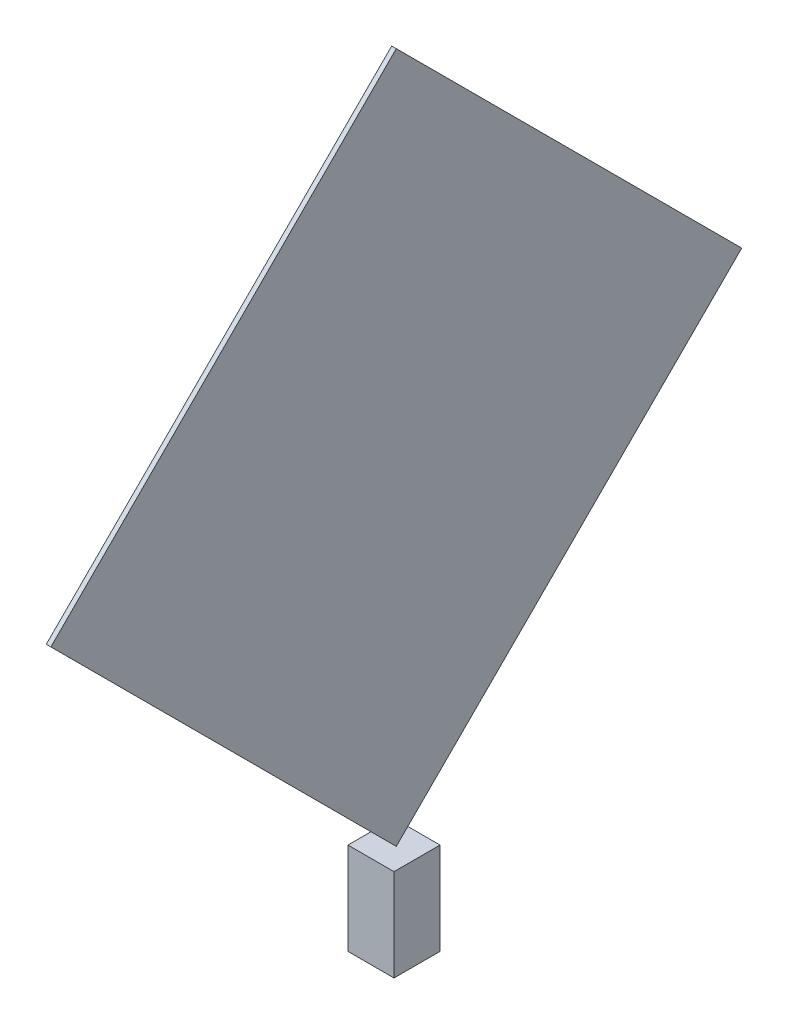
ISO-10303-21;
HEADER;
FILE_DESCRIPTION(('STEP AP214'),'2;1');
FILE_NAME('part.step','',(''),(''),'','','');
FILE_SCHEMA(('AUTOMOTIVE_DESIGN { 1 0 10303 214 1 1 1 1 }'));
ENDSEC;
DATA;
#1=APPLICATION_CONTEXT('core data for automotive mechanical design processes');
#2=APPLICATION_PROTOCOL_DEFINITION('international standard','automotive_design',2000,#1);
#3=PRODUCT_CONTEXT('',#1,'mechanical');
#4=PRODUCT('Part','Part','',(#3));
#5=PRODUCT_RELATED_PRODUCT_CATEGORY('part','',(#4));
#6=PRODUCT_DEFINITION_FORMATION('','',#4);
#7=PRODUCT_DEFINITION_CONTEXT('part definition',#1,'design');
#8=PRODUCT_DEFINITION('design','',#6,#7);
#9=PRODUCT_DEFINITION_SHAPE('','',#8);
#10=(LENGTH_UNIT() NAMED_UNIT(*) SI_UNIT(.MILLI.,.METRE.));
#11=(NAMED_UNIT(*) PLANE_ANGLE_UNIT() SI_UNIT($,.RADIAN.));
#12=(NAMED_UNIT(*) SI_UNIT($,.STERADIAN.) SOLID_ANGLE_UNIT());
#13=UNCERTAINTY_MEASURE_WITH_UNIT(LENGTH_MEASURE(1.E-05),#10,'distance_accuracy_value','');
#14=(GEOMETRIC_REPRESENTATION_CONTEXT(3) GLOBAL_UNCERTAINTY_ASSIGNED_CONTEXT((#13)) GLOBAL_UNIT_ASSIGNED_CONTEXT((#10,
#11,#12)) REPRESENTATION_CONTEXT('',''));
#15=CARTESIAN_POINT('',(0.,0.,0.));
#16=DIRECTION('',(0.,0.,1.));
#17=DIRECTION('',(1.,0.,0.));
#18=AXIS2_PLACEMENT_3D('',#15,#16,#17);
#19=CARTESIAN_POINT('',(-6.80722891566278,950.,-778.313253012048));
#20=DIRECTION('',(0.,0.707106781186547,-0.707106781186548));
#21=DIRECTION('',(0.,0.707106781186548,0.707106781186547));
#22=AXIS2_PLACEMENT_3D('',#19,#20,#21);
#23=PLANE('',#22);
#24=DIRECTION('',(1.,0.,0.));
#25=VECTOR('',#24,1.);
#26=CARTESIAN_POINT('',(-6.80722891566267,1700.,-28.3132530120482));
#27=LINE('',#26,#25);
#28=CARTESIAN_POINT('',(-6.80722891566267,1700.,-28.3132530120482));
#29=VERTEX_POINT('',#28);
#30=CARTESIAN_POINT('',(3.19277108433733,1700.,-28.3132530120482));
#31=VERTEX_POINT('',#30);
#32=EDGE_CURVE('E48',#29,#31,#27,.T.);
#33=ORIENTED_EDGE('',*,*,#32,.T.);
#34=DIRECTION('',(0.,0.707106781186548,0.707106781186547));
#35=VECTOR('',#34,1.);
#36=CARTESIAN_POINT('',(3.19277108433722,950.,-778.313253012048));
#37=LINE('',#36,#35);
#38=CARTESIAN_POINT('',(3.19277108433722,950.,-778.313253012048));
#39=VERTEX_POINT('',#38);
#40=EDGE_CURVE('E85',#39,#31,#37,.T.);
#41=ORIENTED_EDGE('',*,*,#40,.F.);
#42=DIRECTION('',(1.,0.,0.));
#43=VECTOR('',#42,1.);
#44=CARTESIAN_POINT('',(-6.80722891566278,950.,-778.313253012048));
#45=LINE('',#44,#43);
#46=CARTESIAN_POINT('',(-6.80722891566278,950.,-778.313253012048));
#47=VERTEX_POINT('',#46);
#48=EDGE_CURVE('E12',#47,#39,#45,.T.);
#49=ORIENTED_EDGE('',*,*,#48,.F.);
#50=DIRECTION('',(0.,0.707106781186548,0.707106781186547));
#51=VECTOR('',#50,1.);
#52=CARTESIAN_POINT('',(-6.80722891566278,950.,-778.313253012048));
#53=LINE('',#52,#51);
#54=EDGE_CURVE('E86',#47,#29,#53,.T.);
#55=ORIENTED_EDGE('',*,*,#54,.T.);
#56=EDGE_LOOP('',(#33,#41,#49,#55));
#57=FACE_BOUND('',#56,.T.);
#58=ADVANCED_FACE('F45',(#57),#23,.T.);
#59=CARTESIAN_POINT('',(-6.80722891566267,200.,-28.3132530120482));
#60=DIRECTION('',(0.,-0.707106781186548,-0.707106781186548));
#61=DIRECTION('',(0.,0.707106781186547,-0.707106781186548));
#62=AXIS2_PLACEMENT_3D('',#59,#60,#61);
#63=PLANE('',#62);
#64=ORIENTED_EDGE('',*,*,#48,.T.);
#65=DIRECTION('',(0.,0.707106781186548,-0.707106781186548));
#66=VECTOR('',#65,1.);
#67=CARTESIAN_POINT('',(3.19277108433733,200.,-28.3132530120482));
#68=LINE('',#67,#66);
#69=CARTESIAN_POINT('',(3.19277108433733,200.,-28.3132530120482));
#70=VERTEX_POINT('',#69);
#71=EDGE_CURVE('E99',#70,#39,#68,.T.);
#72=ORIENTED_EDGE('',*,*,#71,.F.);
#73=DIRECTION('',(1.,0.,0.));
#74=VECTOR('',#73,1.);
#75=CARTESIAN_POINT('',(-6.80722891566267,200.,-28.3132530120482));
#76=LINE('',#75,#74);
#77=CARTESIAN_POINT('',(-6.80722891566267,200.,-28.3132530120482));
#78=VERTEX_POINT('',#77);
#79=EDGE_CURVE('E53',#78,#70,#76,.T.);
#80=ORIENTED_EDGE('',*,*,#79,.F.);
#81=DIRECTION('',(0.,0.707106781186548,-0.707106781186548));
#82=VECTOR('',#81,1.);
#83=CARTESIAN_POINT('',(-6.80722891566267,200.,-28.3132530120482));
#84=LINE('',#83,#82);
#85=EDGE_CURVE('E91',#78,#47,#84,.T.);
#86=ORIENTED_EDGE('',*,*,#85,.T.);
#87=EDGE_LOOP('',(#64,#72,#80,#86));
#88=FACE_BOUND('',#87,.T.);
#89=ADVANCED_FACE('F117',(#88),#63,.T.);
#90=CARTESIAN_POINT('',(-6.80722891566267,200.,-28.3132530120482));
#91=DIRECTION('',(0.,0.707106781186548,-0.707106781186548));
#92=DIRECTION('',(0.,0.707106781186547,0.707106781186548));
#93=AXIS2_PLACEMENT_3D('',#90,#91,#92);
#94=PLANE('',#93);
#95=ORIENTED_EDGE('',*,*,#79,.T.);
#96=DIRECTION('',(0.,0.707106781186548,0.707106781186548));
#97=VECTOR('',#96,1.);
#98=CARTESIAN_POINT('',(3.19277108433733,200.,-28.3132530120482));
#99=LINE('',#98,#97);
#100=CARTESIAN_POINT('',(3.19277108433743,950.,721.686746987952));
#101=VERTEX_POINT('',#100);
#102=EDGE_CURVE('E103',#70,#101,#99,.T.);
#103=ORIENTED_EDGE('',*,*,#102,.T.);
#104=DIRECTION('',(1.,0.,0.));
#105=VECTOR('',#104,1.);
#106=CARTESIAN_POINT('',(-6.80722891566257,950.,721.686746987952));
#107=LINE('',#106,#105);
#108=CARTESIAN_POINT('',(-6.80722891566257,950.,721.686746987952));
#109=VERTEX_POINT('',#108);
#110=EDGE_CURVE('E90',#109,#101,#107,.T.);
#111=ORIENTED_EDGE('',*,*,#110,.F.);
#112=DIRECTION('',(0.,0.707106781186548,0.707106781186548));
#113=VECTOR('',#112,1.);
#114=CARTESIAN_POINT('',(-6.80722891566267,200.,-28.3132530120482));
#115=LINE('',#114,#113);
#116=EDGE_CURVE('E111',#78,#109,#115,.T.);
#117=ORIENTED_EDGE('',*,*,#116,.F.);
#118=EDGE_LOOP('',(#95,#103,#111,#117));
#119=FACE_BOUND('',#118,.T.);
#120=ADVANCED_FACE('F115',(#119),#94,.F.);
#121=CARTESIAN_POINT('',(-6.80722891566257,950.,721.686746987952));
#122=DIRECTION('',(0.,-0.707106781186547,-0.707106781186548));
#123=DIRECTION('',(0.,0.707106781186548,-0.707106781186547));
#124=AXIS2_PLACEMENT_3D('',#121,#122,#123);
#125=PLANE('',#124);
#126=ORIENTED_EDGE('',*,*,#110,.T.);
#127=DIRECTION('',(0.,0.707106781186548,-0.707106781186547));
#128=VECTOR('',#127,1.);
#129=CARTESIAN_POINT('',(3.19277108433743,950.,721.686746987952));
#130=LINE('',#129,#128);
#131=EDGE_CURVE('E97',#101,#31,#130,.T.);
#132=ORIENTED_EDGE('',*,*,#131,.T.);
#133=ORIENTED_EDGE('',*,*,#32,.F.);
#134=DIRECTION('',(0.,0.707106781186548,-0.707106781186547));
#135=VECTOR('',#134,1.);
#136=CARTESIAN_POINT('',(-6.80722891566257,950.,721.686746987952));
#137=LINE('',#136,#135);
#138=EDGE_CURVE('E109',#109,#29,#137,.T.);
#139=ORIENTED_EDGE('',*,*,#138,.F.);
#140=EDGE_LOOP('',(#126,#132,#133,#139));
#141=FACE_BOUND('',#140,.T.);
#142=ADVANCED_FACE('F101',(#141),#125,.F.);
#143=CARTESIAN_POINT('',(-6.80722891566267,0.,0.));
#144=DIRECTION('',(-1.,0.,0.));
#145=DIRECTION('',(0.,0.,1.));
#146=AXIS2_PLACEMENT_3D('',#143,#144,#145);
#147=PLANE('',#146);
#148=ORIENTED_EDGE('',*,*,#54,.F.);
#149=ORIENTED_EDGE('',*,*,#85,.F.);
#150=ORIENTED_EDGE('',*,*,#116,.T.);
#151=ORIENTED_EDGE('',*,*,#138,.T.);
#152=EDGE_LOOP('',(#148,#149,#150,#151));
#153=FACE_BOUND('',#152,.T.);
#154=ADVANCED_FACE('F119',(#153),#147,.T.);
#155=CARTESIAN_POINT('',(3.19277108433733,0.,0.));
#156=DIRECTION('',(-1.,0.,0.));
#157=DIRECTION('',(0.,0.,1.));
#158=AXIS2_PLACEMENT_3D('',#155,#156,#157);
#159=PLANE('',#158);
#160=ORIENTED_EDGE('',*,*,#40,.T.);
#161=ORIENTED_EDGE('',*,*,#131,.F.);
#162=ORIENTED_EDGE('',*,*,#102,.F.);
#163=ORIENTED_EDGE('',*,*,#71,.T.);
#164=EDGE_LOOP('',(#160,#161,#162,#163));
#165=FACE_BOUND('',#164,.T.);
#166=ADVANCED_FACE('F95',(#165),#159,.F.);
#167=CLOSED_SHELL('',(#58,#89,#120,#142,#154,#166));
#168=MANIFOLD_SOLID_BREP('B2',#167);
#169=CARTESIAN_POINT('',(-51.8072289156627,200.,-78.3132530120481));
#170=DIRECTION('',(1.,0.,0.));
#171=DIRECTION('',(0.,0.,-1.));
#172=AXIS2_PLACEMENT_3D('',#169,#170,#171);
#173=PLANE('',#172);
#174=DIRECTION('',(0.,0.,1.));
#175=VECTOR('',#174,1.);
#176=CARTESIAN_POINT('',(-51.8072289156627,0.,-78.3132530120481));
#177=LINE('',#176,#175);
#178=CARTESIAN_POINT('',(-51.8072289156627,0.,-78.3132530120481));
#179=VERTEX_POINT('',#178);
#180=CARTESIAN_POINT('',(-51.8072289156627,0.,21.6867469879519));
#181=VERTEX_POINT('',#180);
#182=EDGE_CURVE('E232',#179,#181,#177,.T.);
#183=ORIENTED_EDGE('',*,*,#182,.T.);
#184=DIRECTION('',(0.,-1.,0.));
#185=VECTOR('',#184,1.);
#186=CARTESIAN_POINT('',(-51.8072289156627,200.,21.6867469879519));
#187=LINE('',#186,#185);
#188=CARTESIAN_POINT('',(-51.8072289156627,200.,21.6867469879519));
#189=VERTEX_POINT('',#188);
#190=EDGE_CURVE('E43',#189,#181,#187,.T.);
#191=ORIENTED_EDGE('',*,*,#190,.F.);
#192=DIRECTION('',(0.,0.,1.));
#193=VECTOR('',#192,1.);
#194=CARTESIAN_POINT('',(-51.8072289156627,200.,-78.3132530120481));
#195=LINE('',#194,#193);
#196=CARTESIAN_POINT('',(-51.8072289156627,200.,-78.3132530120481));
#197=VERTEX_POINT('',#196);
#198=EDGE_CURVE('E220',#197,#189,#195,.T.);
#199=ORIENTED_EDGE('',*,*,#198,.F.);
#200=DIRECTION('',(0.,-1.,0.));
#201=VECTOR('',#200,1.);
#202=CARTESIAN_POINT('',(-51.8072289156627,200.,-78.3132530120481));
#203=LINE('',#202,#201);
#204=EDGE_CURVE('E228',#197,#179,#203,.T.);
#205=ORIENTED_EDGE('',*,*,#204,.T.);
#206=EDGE_LOOP('',(#183,#191,#199,#205));
#207=FACE_BOUND('',#206,.T.);
#208=ADVANCED_FACE('F169',(#207),#173,.F.);
#209=CARTESIAN_POINT('',(-51.8072289156627,200.,21.6867469879519));
#210=DIRECTION('',(0.,0.,-1.));
#211=DIRECTION('',(-1.,0.,0.));
#212=AXIS2_PLACEMENT_3D('',#209,#210,#211);
#213=PLANE('',#212);
#214=DIRECTION('',(1.,0.,0.));
#215=VECTOR('',#214,1.);
#216=CARTESIAN_POINT('',(-51.8072289156627,0.,21.6867469879519));
#217=LINE('',#216,#215);
#218=CARTESIAN_POINT('',(48.1927710843373,0.,21.6867469879519));
#219=VERTEX_POINT('',#218);
#220=EDGE_CURVE('E224',#181,#219,#217,.T.);
#221=ORIENTED_EDGE('',*,*,#220,.T.);
#222=DIRECTION('',(0.,-1.,0.));
#223=VECTOR('',#222,1.);
#224=CARTESIAN_POINT('',(48.1927710843373,200.,21.6867469879519));
#225=LINE('',#224,#223);
#226=CARTESIAN_POINT('',(48.1927710843373,200.,21.6867469879519));
#227=VERTEX_POINT('',#226);
#228=EDGE_CURVE('E177',#227,#219,#225,.T.);
#229=ORIENTED_EDGE('',*,*,#228,.F.);
#230=DIRECTION('',(1.,0.,0.));
#231=VECTOR('',#230,1.);
#232=CARTESIAN_POINT('',(-51.8072289156627,200.,21.6867469879519));
#233=LINE('',#232,#231);
#234=EDGE_CURVE('E215',#189,#227,#233,.T.);
#235=ORIENTED_EDGE('',*,*,#234,.F.);
#236=ORIENTED_EDGE('',*,*,#190,.T.);
#237=EDGE_LOOP('',(#221,#229,#235,#236));
#238=FACE_BOUND('',#237,.T.);
#239=ADVANCED_FACE('F223',(#238),#213,.F.);
#240=CARTESIAN_POINT('',(48.1927710843373,200.,-78.3132530120481));
#241=DIRECTION('',(-1.,0.,0.));
#242=DIRECTION('',(0.,0.,1.));
#243=AXIS2_PLACEMENT_3D('',#240,#241,#242);
#244=PLANE('',#243);
#245=DIRECTION('',(0.,0.,-1.));
#246=VECTOR('',#245,1.);
#247=CARTESIAN_POINT('',(48.1927710843373,0.,-78.3132530120481));
#248=LINE('',#247,#246);
#249=CARTESIAN_POINT('',(48.1927710843373,0.,-78.3132530120481));
#250=VERTEX_POINT('',#249);
#251=EDGE_CURVE('E202',#219,#250,#248,.T.);
#252=ORIENTED_EDGE('',*,*,#251,.T.);
#253=DIRECTION('',(0.,-1.,0.));
#254=VECTOR('',#253,1.);
#255=CARTESIAN_POINT('',(48.1927710843373,200.,-78.3132530120481));
#256=LINE('',#255,#254);
#257=CARTESIAN_POINT('',(48.1927710843373,200.,-78.3132530120481));
#258=VERTEX_POINT('',#257);
#259=EDGE_CURVE('E225',#258,#250,#256,.T.);
#260=ORIENTED_EDGE('',*,*,#259,.F.);
#261=DIRECTION('',(0.,0.,-1.));
#262=VECTOR('',#261,1.);
#263=CARTESIAN_POINT('',(48.1927710843373,200.,-78.3132530120481));
#264=LINE('',#263,#262);
#265=EDGE_CURVE('E218',#227,#258,#264,.T.);
#266=ORIENTED_EDGE('',*,*,#265,.F.);
#267=ORIENTED_EDGE('',*,*,#228,.T.);
#268=EDGE_LOOP('',(#252,#260,#266,#267));
#269=FACE_BOUND('',#268,.T.);
#270=ADVANCED_FACE('F226',(#269),#244,.F.);
#271=CARTESIAN_POINT('',(-51.8072289156627,200.,-78.3132530120481));
#272=DIRECTION('',(0.,0.,1.));
#273=DIRECTION('',(1.,0.,0.));
#274=AXIS2_PLACEMENT_3D('',#271,#272,#273);
#275=PLANE('',#274);
#276=DIRECTION('',(-1.,0.,0.));
#277=VECTOR('',#276,1.);
#278=CARTESIAN_POINT('',(-51.8072289156627,0.,-78.3132530120481));
#279=LINE('',#278,#277);
#280=EDGE_CURVE('E208',#250,#179,#279,.T.);
#281=ORIENTED_EDGE('',*,*,#280,.T.);
#282=ORIENTED_EDGE('',*,*,#204,.F.);
#283=DIRECTION('',(-1.,0.,0.));
#284=VECTOR('',#283,1.);
#285=CARTESIAN_POINT('',(-51.8072289156627,200.,-78.3132530120481));
#286=LINE('',#285,#284);
#287=EDGE_CURVE('E185',#258,#197,#286,.T.);
#288=ORIENTED_EDGE('',*,*,#287,.F.);
#289=ORIENTED_EDGE('',*,*,#259,.T.);
#290=EDGE_LOOP('',(#281,#282,#288,#289));
#291=FACE_BOUND('',#290,.T.);
#292=ADVANCED_FACE('F239',(#291),#275,.F.);
#293=CARTESIAN_POINT('',(0.,200.,0.));
#294=DIRECTION('',(0.,1.,0.));
#295=DIRECTION('',(0.,0.,1.));
#296=AXIS2_PLACEMENT_3D('',#293,#294,#295);
#297=PLANE('',#296);
#298=ORIENTED_EDGE('',*,*,#198,.T.);
#299=ORIENTED_EDGE('',*,*,#234,.T.);
#300=ORIENTED_EDGE('',*,*,#265,.T.);
#301=ORIENTED_EDGE('',*,*,#287,.T.);
#302=EDGE_LOOP('',(#298,#299,#300,#301));
#303=FACE_BOUND('',#302,.T.);
#304=ADVANCED_FACE('F216',(#303),#297,.T.);
#305=CARTESIAN_POINT('',(0.,0.,0.));
#306=DIRECTION('',(0.,1.,0.));
#307=DIRECTION('',(0.,0.,1.));
#308=AXIS2_PLACEMENT_3D('',#305,#306,#307);
#309=PLANE('',#308);
#310=ORIENTED_EDGE('',*,*,#182,.F.);
#311=ORIENTED_EDGE('',*,*,#280,.F.);
#312=ORIENTED_EDGE('',*,*,#251,.F.);
#313=ORIENTED_EDGE('',*,*,#220,.F.);
#314=EDGE_LOOP('',(#310,#311,#312,#313));
#315=FACE_BOUND('',#314,.T.);
#316=ADVANCED_FACE('F242',(#315),#309,.F.);
#317=CLOSED_SHELL('',(#208,#239,#270,#292,#304,#316));
#318=MANIFOLD_SOLID_BREP('B6',#317);
#319=ADVANCED_BREP_SHAPE_REPRESENTATION('',(#18,#168,#318),#14);
#320=SHAPE_DEFINITION_REPRESENTATION(#9,#319);
ENDSEC;
END-ISO-10303-21;
